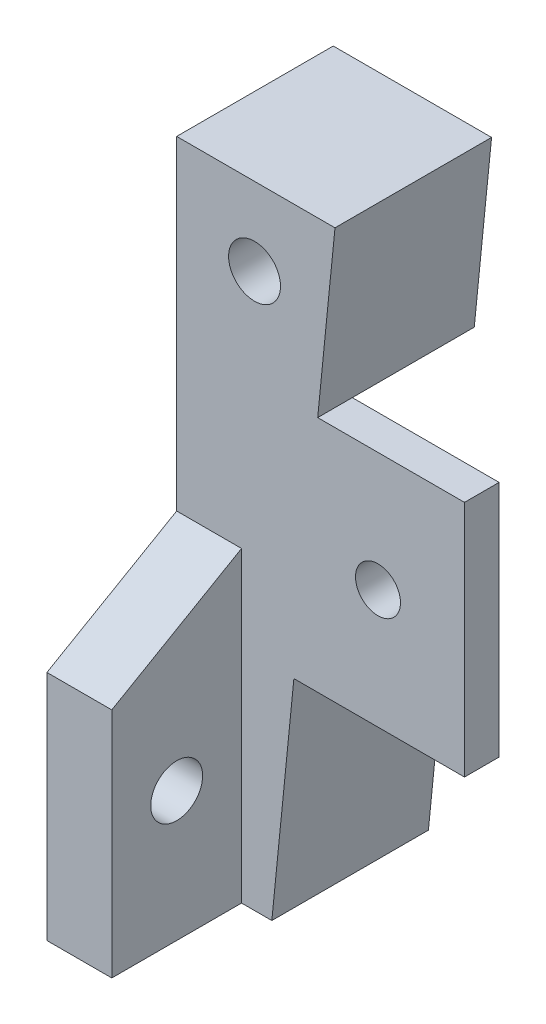
ISO-10303-21;
HEADER;
FILE_DESCRIPTION(('STEP AP214'),'2;1');
FILE_NAME('part.step','',(''),(''),'','','');
FILE_SCHEMA(('AUTOMOTIVE_DESIGN { 1 0 10303 214 1 1 1 1 }'));
ENDSEC;
DATA;
#1=APPLICATION_CONTEXT('core data for automotive mechanical design processes');
#2=APPLICATION_PROTOCOL_DEFINITION('international standard','automotive_design',2000,#1);
#3=PRODUCT_CONTEXT('',#1,'mechanical');
#4=PRODUCT('Part','Part','',(#3));
#5=PRODUCT_RELATED_PRODUCT_CATEGORY('part','',(#4));
#6=PRODUCT_DEFINITION_FORMATION('','',#4);
#7=PRODUCT_DEFINITION_CONTEXT('part definition',#1,'design');
#8=PRODUCT_DEFINITION('design','',#6,#7);
#9=PRODUCT_DEFINITION_SHAPE('','',#8);
#10=(LENGTH_UNIT() NAMED_UNIT(*) SI_UNIT(.MILLI.,.METRE.));
#11=(NAMED_UNIT(*) PLANE_ANGLE_UNIT() SI_UNIT($,.RADIAN.));
#12=(NAMED_UNIT(*) SI_UNIT($,.STERADIAN.) SOLID_ANGLE_UNIT());
#13=UNCERTAINTY_MEASURE_WITH_UNIT(LENGTH_MEASURE(1.E-05),#10,'distance_accuracy_value','');
#14=(GEOMETRIC_REPRESENTATION_CONTEXT(3) GLOBAL_UNCERTAINTY_ASSIGNED_CONTEXT((#13)) GLOBAL_UNIT_ASSIGNED_CONTEXT((#10,
#11,#12)) REPRESENTATION_CONTEXT('',''));
#15=CARTESIAN_POINT('',(0.,0.,0.));
#16=DIRECTION('',(0.,0.,1.));
#17=DIRECTION('',(1.,0.,0.));
#18=AXIS2_PLACEMENT_3D('',#15,#16,#17);
#19=CARTESIAN_POINT('',(0.,0.,14.1000000000013));
#20=DIRECTION('',(0.,0.,1.));
#21=DIRECTION('',(1.,0.,0.));
#22=AXIS2_PLACEMENT_3D('',#19,#20,#21);
#23=PLANE('',#22);
#24=CARTESIAN_POINT('',(137.270000000002,-335.749999999999,14.1000000000013));
#25=DIRECTION('',(0.,0.,1.));
#26=DIRECTION('',(1.,0.,0.));
#27=AXIS2_PLACEMENT_3D('',#24,#25,#26);
#28=CIRCLE('',#27,2.59999999999999);
#29=CARTESIAN_POINT('',(139.870000000002,-335.749999999999,14.1000000000013));
#30=VERTEX_POINT('',#29);
#31=EDGE_CURVE('E189',#30,#30,#28,.T.);
#32=ORIENTED_EDGE('',*,*,#31,.T.);
#33=EDGE_LOOP('',(#32));
#34=FACE_BOUND('',#33,.T.);
#35=DIRECTION('',(1.,0.,0.));
#36=VECTOR('',#35,1.);
#37=CARTESIAN_POINT('',(130.3,-321.999999999999,14.1000000000013));
#38=LINE('',#37,#36);
#39=CARTESIAN_POINT('',(114.000000000002,-321.999999999999,14.1000000000013));
#40=VERTEX_POINT('',#39);
#41=CARTESIAN_POINT('',(130.3,-321.999999999999,14.1000000000013));
#42=VERTEX_POINT('',#41);
#43=EDGE_CURVE('E208',#40,#42,#38,.T.);
#44=ORIENTED_EDGE('',*,*,#43,.T.);
#45=DIRECTION('',(1.,0.,0.));
#46=VECTOR('',#45,1.);
#47=CARTESIAN_POINT('',(-2.98656486156187E-11,-321.999999999986,14.1000000000013));
#48=LINE('',#47,#46);
#49=CARTESIAN_POINT('',(147.270000000011,-322.,14.1000000000013));
#50=VERTEX_POINT('',#49);
#51=EDGE_CURVE('E220',#42,#50,#48,.T.);
#52=ORIENTED_EDGE('',*,*,#51,.T.);
#53=DIRECTION('',(0.,1.,0.));
#54=VECTOR('',#53,1.);
#55=CARTESIAN_POINT('',(147.270000000011,-322.,14.1000000000013));
#56=LINE('',#55,#54);
#57=CARTESIAN_POINT('',(147.270000000011,-349.5,14.1000000000013));
#58=VERTEX_POINT('',#57);
#59=EDGE_CURVE('E198',#58,#50,#56,.T.);
#60=ORIENTED_EDGE('',*,*,#59,.F.);
#61=DIRECTION('',(-1.,0.,0.));
#62=VECTOR('',#61,1.);
#63=CARTESIAN_POINT('',(-2.63602545588444E-11,-349.499999999989,14.1000000000013));
#64=LINE('',#63,#62);
#65=CARTESIAN_POINT('',(127.55,-349.499999999999,14.1000000000013));
#66=VERTEX_POINT('',#65);
#67=EDGE_CURVE('E226',#58,#66,#64,.T.);
#68=ORIENTED_EDGE('',*,*,#67,.T.);
#69=DIRECTION('',(-1.,0.,0.));
#70=VECTOR('',#69,1.);
#71=CARTESIAN_POINT('',(127.55,-349.499999999999,14.1000000000013));
#72=LINE('',#71,#70);
#73=CARTESIAN_POINT('',(114.000000000002,-349.499999999999,14.1000000000013));
#74=VERTEX_POINT('',#73);
#75=EDGE_CURVE('E256',#66,#74,#72,.T.);
#76=ORIENTED_EDGE('',*,*,#75,.T.);
#77=DIRECTION('',(0.,1.,0.));
#78=VECTOR('',#77,1.);
#79=CARTESIAN_POINT('',(114.000000000002,0.,14.1000000000013));
#80=LINE('',#79,#78);
#81=EDGE_CURVE('E243',#74,#40,#80,.T.);
#82=ORIENTED_EDGE('',*,*,#81,.T.);
#83=EDGE_LOOP('',(#44,#52,#60,#68,#76,#82));
#84=FACE_BOUND('',#83,.T.);
#85=ADVANCED_FACE('F51',(#34,#84),#23,.F.);
#86=CARTESIAN_POINT('',(114.000000000002,-374.999999999999,42.976504289822));
#87=DIRECTION('',(1.36254643931287E-13,1.,0.));
#88=DIRECTION('',(-1.,1.36254643931287E-13,0.));
#89=AXIS2_PLACEMENT_3D('',#86,#87,#88);
#90=PLANE('',#89);
#91=DIRECTION('',(0.,0.,-1.));
#92=VECTOR('',#91,1.);
#93=CARTESIAN_POINT('',(125.,-375.,42.976504289822));
#94=LINE('',#93,#92);
#95=CARTESIAN_POINT('',(125.,-375.,18.1000000000013));
#96=VERTEX_POINT('',#95);
#97=CARTESIAN_POINT('',(125.,-375.,0.));
#98=VERTEX_POINT('',#97);
#99=EDGE_CURVE('E265',#96,#98,#94,.T.);
#100=ORIENTED_EDGE('',*,*,#99,.F.);
#101=DIRECTION('',(1.,-1.36254643931287E-13,0.));
#102=VECTOR('',#101,1.);
#103=CARTESIAN_POINT('',(-5.10954914742303E-11,-374.999999999983,18.1000000000013));
#104=LINE('',#103,#102);
#105=CARTESIAN_POINT('',(121.500000000002,-374.999999999999,18.1000000000013));
#106=VERTEX_POINT('',#105);
#107=EDGE_CURVE('E234',#106,#96,#104,.T.);
#108=ORIENTED_EDGE('',*,*,#107,.F.);
#109=DIRECTION('',(0.,0.,-1.));
#110=VECTOR('',#109,1.);
#111=CARTESIAN_POINT('',(121.500000000002,-374.999999999999,33.1000000000013));
#112=LINE('',#111,#110);
#113=CARTESIAN_POINT('',(121.500000000002,-374.999999999999,33.1000000000013));
#114=VERTEX_POINT('',#113);
#115=EDGE_CURVE('E167',#114,#106,#112,.T.);
#116=ORIENTED_EDGE('',*,*,#115,.F.);
#117=DIRECTION('',(1.,0.,0.));
#118=VECTOR('',#117,1.);
#119=CARTESIAN_POINT('',(114.000000000002,-374.999999999999,33.1000000000013));
#120=LINE('',#119,#118);
#121=CARTESIAN_POINT('',(114.000000000002,-374.999999999999,33.1000000000013));
#122=VERTEX_POINT('',#121);
#123=EDGE_CURVE('E162',#122,#114,#120,.T.);
#124=ORIENTED_EDGE('',*,*,#123,.F.);
#125=DIRECTION('',(0.,0.,-1.));
#126=VECTOR('',#125,1.);
#127=CARTESIAN_POINT('',(114.000000000002,-374.999999999999,42.976504289822));
#128=LINE('',#127,#126);
#129=CARTESIAN_POINT('',(114.000000000002,-374.999999999999,0.));
#130=VERTEX_POINT('',#129);
#131=EDGE_CURVE('E150',#122,#130,#128,.T.);
#132=ORIENTED_EDGE('',*,*,#131,.T.);
#133=DIRECTION('',(1.,-1.36254643931287E-13,0.));
#134=VECTOR('',#133,1.);
#135=CARTESIAN_POINT('',(114.000000000002,-374.999999999999,0.));
#136=LINE('',#135,#134);
#137=EDGE_CURVE('E158',#130,#98,#136,.T.);
#138=ORIENTED_EDGE('',*,*,#137,.T.);
#139=EDGE_LOOP('',(#100,#108,#116,#124,#132,#138));
#140=FACE_BOUND('',#139,.T.);
#141=ADVANCED_FACE('F164',(#140),#90,.F.);
#142=CARTESIAN_POINT('',(125.,-375.,42.976504289822));
#143=DIRECTION('',(-0.995037190209989,0.0995037190209987,0.));
#144=DIRECTION('',(-0.0995037190209987,-0.995037190209989,0.));
#145=AXIS2_PLACEMENT_3D('',#142,#143,#144);
#146=PLANE('',#145);
#147=DIRECTION('',(0.,0.,-1.));
#148=VECTOR('',#147,1.);
#149=CARTESIAN_POINT('',(127.55,-349.499999999999,42.976504289822));
#150=LINE('',#149,#148);
#151=CARTESIAN_POINT('',(127.55,-349.499999999999,0.));
#152=VERTEX_POINT('',#151);
#153=EDGE_CURVE('E261',#66,#152,#150,.T.);
#154=ORIENTED_EDGE('',*,*,#153,.F.);
#155=DIRECTION('',(0.,0.,-1.));
#156=VECTOR('',#155,1.);
#157=CARTESIAN_POINT('',(127.55,-349.499999999999,18.1000000000013));
#158=LINE('',#157,#156);
#159=CARTESIAN_POINT('',(127.55,-349.499999999999,18.1000000000013));
#160=VERTEX_POINT('',#159);
#161=EDGE_CURVE('E241',#160,#66,#158,.T.);
#162=ORIENTED_EDGE('',*,*,#161,.F.);
#163=DIRECTION('',(0.0995037190209987,0.995037190209989,0.));
#164=VECTOR('',#163,1.);
#165=CARTESIAN_POINT('',(160.891089108911,-16.0891089108911,18.1000000000013));
#166=LINE('',#165,#164);
#167=EDGE_CURVE('E236',#96,#160,#166,.T.);
#168=ORIENTED_EDGE('',*,*,#167,.F.);
#169=ORIENTED_EDGE('',*,*,#99,.T.);
#170=DIRECTION('',(0.0995037190209987,0.995037190209989,0.));
#171=VECTOR('',#170,1.);
#172=CARTESIAN_POINT('',(125.,-375.,0.));
#173=LINE('',#172,#171);
#174=EDGE_CURVE('E262',#98,#152,#173,.T.);
#175=ORIENTED_EDGE('',*,*,#174,.T.);
#176=EDGE_LOOP('',(#154,#162,#168,#169,#175));
#177=FACE_BOUND('',#176,.T.);
#178=ADVANCED_FACE('F294',(#177),#146,.F.);
#179=CARTESIAN_POINT('',(127.55,-349.499999999999,42.976504289822));
#180=DIRECTION('',(0.,-1.,0.));
#181=DIRECTION('',(0.,0.,-1.));
#182=AXIS2_PLACEMENT_3D('',#179,#180,#181);
#183=PLANE('',#182);
#184=ORIENTED_EDGE('',*,*,#75,.F.);
#185=ORIENTED_EDGE('',*,*,#153,.T.);
#186=DIRECTION('',(-1.,0.,0.));
#187=VECTOR('',#186,1.);
#188=CARTESIAN_POINT('',(127.55,-349.499999999999,0.));
#189=LINE('',#188,#187);
#190=CARTESIAN_POINT('',(114.000000000002,-349.499999999999,0.));
#191=VERTEX_POINT('',#190);
#192=EDGE_CURVE('E258',#152,#191,#189,.T.);
#193=ORIENTED_EDGE('',*,*,#192,.T.);
#194=DIRECTION('',(0.,0.,-1.));
#195=VECTOR('',#194,1.);
#196=CARTESIAN_POINT('',(114.000000000002,-349.499999999999,42.976504289822));
#197=LINE('',#196,#195);
#198=EDGE_CURVE('E257',#74,#191,#197,.T.);
#199=ORIENTED_EDGE('',*,*,#198,.F.);
#200=EDGE_LOOP('',(#184,#185,#193,#199));
#201=FACE_BOUND('',#200,.T.);
#202=ADVANCED_FACE('F325',(#201),#183,.F.);
#203=CARTESIAN_POINT('',(114.000000000002,-349.499999999999,42.976504289822));
#204=DIRECTION('',(1.,0.,0.));
#205=DIRECTION('',(0.,0.,-1.));
#206=AXIS2_PLACEMENT_3D('',#203,#204,#205);
#207=PLANE('',#206);
#208=CARTESIAN_POINT('',(114.000000000002,-359.999999999998,25.6000000000013));
#209=DIRECTION('',(1.,0.,0.));
#210=DIRECTION('',(0.,0.,-1.));
#211=AXIS2_PLACEMENT_3D('',#208,#209,#210);
#212=CIRCLE('',#211,3.);
#213=CARTESIAN_POINT('',(114.000000000002,-359.999999999998,22.6000000000013));
#214=VERTEX_POINT('',#213);
#215=EDGE_CURVE('E175',#214,#214,#212,.T.);
#216=ORIENTED_EDGE('',*,*,#215,.T.);
#217=EDGE_LOOP('',(#216));
#218=FACE_BOUND('',#217,.T.);
#219=ORIENTED_EDGE('',*,*,#131,.F.);
#220=DIRECTION('',(0.,-1.,0.));
#221=VECTOR('',#220,1.);
#222=CARTESIAN_POINT('',(114.000000000002,-374.999999999999,33.1000000000013));
#223=LINE('',#222,#221);
#224=CARTESIAN_POINT('',(114.000000000002,-348.160254037843,33.1000000000013));
#225=VERTEX_POINT('',#224);
#226=EDGE_CURVE('E74',#225,#122,#223,.T.);
#227=ORIENTED_EDGE('',*,*,#226,.F.);
#228=DIRECTION('',(0.,0.499999999999996,-0.866025403784441));
#229=VECTOR('',#228,1.);
#230=CARTESIAN_POINT('',(114.000000000002,-352.771842336167,41.0875052362892));
#231=LINE('',#230,#229);
#232=CARTESIAN_POINT('',(114.000000000002,-339.499999999998,18.1000000000013));
#233=VERTEX_POINT('',#232);
#234=EDGE_CURVE('E60',#225,#233,#231,.T.);
#235=ORIENTED_EDGE('',*,*,#234,.T.);
#236=DIRECTION('',(0.,1.,0.));
#237=VECTOR('',#236,1.);
#238=CARTESIAN_POINT('',(114.000000000002,0.,18.1000000000013));
#239=LINE('',#238,#237);
#240=CARTESIAN_POINT('',(114.000000000002,-301.999999999999,18.1000000000013));
#241=VERTEX_POINT('',#240);
#242=EDGE_CURVE('E232',#233,#241,#239,.T.);
#243=ORIENTED_EDGE('',*,*,#242,.T.);
#244=DIRECTION('',(0.,0.,-1.));
#245=VECTOR('',#244,1.);
#246=CARTESIAN_POINT('',(114.000000000002,-301.999999999999,18.1000000000013));
#247=LINE('',#246,#245);
#248=CARTESIAN_POINT('',(114.000000000002,-301.999999999999,0.));
#249=VERTEX_POINT('',#248);
#250=EDGE_CURVE('E249',#241,#249,#247,.T.);
#251=ORIENTED_EDGE('',*,*,#250,.T.);
#252=DIRECTION('',(0.,-1.,0.));
#253=VECTOR('',#252,1.);
#254=CARTESIAN_POINT('',(114.000000000002,-321.999999999999,0.));
#255=LINE('',#254,#253);
#256=CARTESIAN_POINT('',(114.000000000002,-321.999999999999,0.));
#257=VERTEX_POINT('',#256);
#258=EDGE_CURVE('E214',#249,#257,#255,.T.);
#259=ORIENTED_EDGE('',*,*,#258,.T.);
#260=DIRECTION('',(0.,0.,-1.));
#261=VECTOR('',#260,1.);
#262=CARTESIAN_POINT('',(114.000000000002,-321.999999999999,42.976504289822));
#263=LINE('',#262,#261);
#264=EDGE_CURVE('E213',#40,#257,#263,.T.);
#265=ORIENTED_EDGE('',*,*,#264,.F.);
#266=ORIENTED_EDGE('',*,*,#81,.F.);
#267=ORIENTED_EDGE('',*,*,#198,.T.);
#268=DIRECTION('',(0.,-1.,0.));
#269=VECTOR('',#268,1.);
#270=CARTESIAN_POINT('',(114.000000000002,-349.499999999999,0.));
#271=LINE('',#270,#269);
#272=EDGE_CURVE('E154',#191,#130,#271,.T.);
#273=ORIENTED_EDGE('',*,*,#272,.T.);
#274=EDGE_LOOP('',(#219,#227,#235,#243,#251,#259,#265,#266,#267,#273));
#275=FACE_BOUND('',#274,.T.);
#276=ADVANCED_FACE('F152',(#218,#275),#207,.F.);
#277=CARTESIAN_POINT('',(0.,0.,0.));
#278=DIRECTION('',(0.,0.,-1.));
#279=DIRECTION('',(-1.,0.,0.));
#280=AXIS2_PLACEMENT_3D('',#277,#278,#279);
#281=PLANE('',#280);
#282=ORIENTED_EDGE('',*,*,#137,.F.);
#283=ORIENTED_EDGE('',*,*,#272,.F.);
#284=ORIENTED_EDGE('',*,*,#192,.F.);
#285=ORIENTED_EDGE('',*,*,#174,.F.);
#286=EDGE_LOOP('',(#282,#283,#284,#285));
#287=FACE_BOUND('',#286,.T.);
#288=ADVANCED_FACE('F328',(#287),#281,.T.);
#289=CARTESIAN_POINT('',(-2.98656486156187E-11,-321.999999999986,18.1000000000013));
#290=DIRECTION('',(0.,1.,0.));
#291=DIRECTION('',(-1.,0.,0.));
#292=AXIS2_PLACEMENT_3D('',#289,#290,#291);
#293=PLANE('',#292);
#294=ORIENTED_EDGE('',*,*,#51,.F.);
#295=DIRECTION('',(0.,0.,-1.));
#296=VECTOR('',#295,1.);
#297=CARTESIAN_POINT('',(130.3,-321.999999999999,18.1000000000013));
#298=LINE('',#297,#296);
#299=CARTESIAN_POINT('',(130.3,-321.999999999999,18.1000000000013));
#300=VERTEX_POINT('',#299);
#301=EDGE_CURVE('E159',#300,#42,#298,.T.);
#302=ORIENTED_EDGE('',*,*,#301,.F.);
#303=DIRECTION('',(1.,0.,0.));
#304=VECTOR('',#303,1.);
#305=CARTESIAN_POINT('',(-2.98656486156187E-11,-321.999999999986,18.1000000000013));
#306=LINE('',#305,#304);
#307=CARTESIAN_POINT('',(147.270000000011,-322.,18.1000000000013));
#308=VERTEX_POINT('',#307);
#309=EDGE_CURVE('E223',#300,#308,#306,.T.);
#310=ORIENTED_EDGE('',*,*,#309,.T.);
#311=DIRECTION('',(0.,0.,1.));
#312=VECTOR('',#311,1.);
#313=CARTESIAN_POINT('',(147.270000000011,-322.,18.1000000000013));
#314=LINE('',#313,#312);
#315=EDGE_CURVE('E201',#50,#308,#314,.T.);
#316=ORIENTED_EDGE('',*,*,#315,.F.);
#317=EDGE_LOOP('',(#294,#302,#310,#316));
#318=FACE_BOUND('',#317,.T.);
#319=ADVANCED_FACE('F306',(#318),#293,.T.);
#320=CARTESIAN_POINT('',(160.891089108911,-16.0891089108911,18.1000000000013));
#321=DIRECTION('',(0.995037190209989,-0.0995037190209989,0.));
#322=DIRECTION('',(0.0995037190209989,0.995037190209989,0.));
#323=AXIS2_PLACEMENT_3D('',#320,#321,#322);
#324=PLANE('',#323);
#325=ORIENTED_EDGE('',*,*,#301,.T.);
#326=DIRECTION('',(0.,0.,-1.));
#327=VECTOR('',#326,1.);
#328=CARTESIAN_POINT('',(130.3,-321.999999999999,42.976504289822));
#329=LINE('',#328,#327);
#330=CARTESIAN_POINT('',(130.3,-321.999999999999,0.));
#331=VERTEX_POINT('',#330);
#332=EDGE_CURVE('E209',#42,#331,#329,.T.);
#333=ORIENTED_EDGE('',*,*,#332,.T.);
#334=DIRECTION('',(0.0995037190209989,0.995037190209989,0.));
#335=VECTOR('',#334,1.);
#336=CARTESIAN_POINT('',(132.3,-301.999999999999,0.));
#337=LINE('',#336,#335);
#338=CARTESIAN_POINT('',(132.3,-301.999999999999,0.));
#339=VERTEX_POINT('',#338);
#340=EDGE_CURVE('E205',#331,#339,#337,.T.);
#341=ORIENTED_EDGE('',*,*,#340,.T.);
#342=DIRECTION('',(0.,0.,-1.));
#343=VECTOR('',#342,1.);
#344=CARTESIAN_POINT('',(132.3,-301.999999999999,18.1000000000013));
#345=LINE('',#344,#343);
#346=CARTESIAN_POINT('',(132.3,-301.999999999999,18.1000000000013));
#347=VERTEX_POINT('',#346);
#348=EDGE_CURVE('E251',#347,#339,#345,.T.);
#349=ORIENTED_EDGE('',*,*,#348,.F.);
#350=DIRECTION('',(-0.0995037190209988,-0.995037190209989,0.));
#351=VECTOR('',#350,1.);
#352=CARTESIAN_POINT('',(160.891089108911,-16.0891089108911,18.1000000000013));
#353=LINE('',#352,#351);
#354=EDGE_CURVE('E225',#347,#300,#353,.T.);
#355=ORIENTED_EDGE('',*,*,#354,.T.);
#356=EDGE_LOOP('',(#325,#333,#341,#349,#355));
#357=FACE_BOUND('',#356,.T.);
#358=ADVANCED_FACE('F309',(#357),#324,.T.);
#359=CARTESIAN_POINT('',(0.,-301.999999999999,18.1000000000013));
#360=DIRECTION('',(0.,1.,0.));
#361=DIRECTION('',(0.,0.,1.));
#362=AXIS2_PLACEMENT_3D('',#359,#360,#361);
#363=PLANE('',#362);
#364=ORIENTED_EDGE('',*,*,#348,.T.);
#365=DIRECTION('',(-1.,0.,0.));
#366=VECTOR('',#365,1.);
#367=CARTESIAN_POINT('',(114.000000000002,-301.999999999999,0.));
#368=LINE('',#367,#366);
#369=EDGE_CURVE('E204',#339,#249,#368,.T.);
#370=ORIENTED_EDGE('',*,*,#369,.T.);
#371=ORIENTED_EDGE('',*,*,#250,.F.);
#372=DIRECTION('',(1.,0.,0.));
#373=VECTOR('',#372,1.);
#374=CARTESIAN_POINT('',(0.,-301.999999999999,18.1000000000013));
#375=LINE('',#374,#373);
#376=EDGE_CURVE('E229',#241,#347,#375,.T.);
#377=ORIENTED_EDGE('',*,*,#376,.T.);
#378=EDGE_LOOP('',(#364,#370,#371,#377));
#379=FACE_BOUND('',#378,.T.);
#380=ADVANCED_FACE('F313',(#379),#363,.T.);
#381=CARTESIAN_POINT('',(-2.63602545588444E-11,-349.499999999989,18.1000000000013));
#382=DIRECTION('',(0.,-1.,0.));
#383=DIRECTION('',(1.,0.,0.));
#384=AXIS2_PLACEMENT_3D('',#381,#382,#383);
#385=PLANE('',#384);
#386=ORIENTED_EDGE('',*,*,#67,.F.);
#387=DIRECTION('',(0.,0.,-1.));
#388=VECTOR('',#387,1.);
#389=CARTESIAN_POINT('',(147.270000000011,-349.5,18.1000000000013));
#390=LINE('',#389,#388);
#391=CARTESIAN_POINT('',(147.270000000011,-349.5,18.1000000000013));
#392=VERTEX_POINT('',#391);
#393=EDGE_CURVE('E195',#392,#58,#390,.T.);
#394=ORIENTED_EDGE('',*,*,#393,.F.);
#395=DIRECTION('',(-1.,0.,0.));
#396=VECTOR('',#395,1.);
#397=CARTESIAN_POINT('',(-2.63602545588444E-11,-349.499999999989,18.1000000000013));
#398=LINE('',#397,#396);
#399=EDGE_CURVE('E238',#392,#160,#398,.T.);
#400=ORIENTED_EDGE('',*,*,#399,.T.);
#401=ORIENTED_EDGE('',*,*,#161,.T.);
#402=EDGE_LOOP('',(#386,#394,#400,#401));
#403=FACE_BOUND('',#402,.T.);
#404=ADVANCED_FACE('F299',(#403),#385,.T.);
#405=CARTESIAN_POINT('',(0.,0.,18.1000000000013));
#406=DIRECTION('',(0.,0.,1.));
#407=DIRECTION('',(1.,0.,0.));
#408=AXIS2_PLACEMENT_3D('',#405,#406,#407);
#409=PLANE('',#408);
#410=ORIENTED_EDGE('',*,*,#242,.F.);
#411=DIRECTION('',(1.,0.,0.));
#412=VECTOR('',#411,1.);
#413=CARTESIAN_POINT('',(0.,-339.499999999998,18.1000000000013));
#414=LINE('',#413,#412);
#415=CARTESIAN_POINT('',(121.500000000002,-339.499999999998,18.1000000000013));
#416=VERTEX_POINT('',#415);
#417=EDGE_CURVE('E269',#233,#416,#414,.T.);
#418=ORIENTED_EDGE('',*,*,#417,.T.);
#419=DIRECTION('',(0.,1.,0.));
#420=VECTOR('',#419,1.);
#421=CARTESIAN_POINT('',(121.500000000002,-374.999999999999,18.1000000000013));
#422=LINE('',#421,#420);
#423=EDGE_CURVE('E173',#106,#416,#422,.T.);
#424=ORIENTED_EDGE('',*,*,#423,.F.);
#425=ORIENTED_EDGE('',*,*,#107,.T.);
#426=ORIENTED_EDGE('',*,*,#167,.T.);
#427=ORIENTED_EDGE('',*,*,#399,.F.);
#428=DIRECTION('',(0.,-1.,0.));
#429=VECTOR('',#428,1.);
#430=CARTESIAN_POINT('',(147.270000000011,-322.,18.1000000000013));
#431=LINE('',#430,#429);
#432=EDGE_CURVE('E192',#308,#392,#431,.T.);
#433=ORIENTED_EDGE('',*,*,#432,.F.);
#434=ORIENTED_EDGE('',*,*,#309,.F.);
#435=ORIENTED_EDGE('',*,*,#354,.F.);
#436=ORIENTED_EDGE('',*,*,#376,.F.);
#437=EDGE_LOOP('',(#410,#418,#424,#425,#426,#427,#433,#434,#435,#436));
#438=FACE_BOUND('',#437,.T.);
#439=CARTESIAN_POINT('',(137.270000000002,-335.749999999999,18.1000000000013));
#440=DIRECTION('',(0.,0.,1.));
#441=DIRECTION('',(1.,0.,0.));
#442=AXIS2_PLACEMENT_3D('',#439,#440,#441);
#443=CIRCLE('',#442,2.59999999999999);
#444=CARTESIAN_POINT('',(139.870000000002,-335.749999999999,18.1000000000013));
#445=VERTEX_POINT('',#444);
#446=EDGE_CURVE('E183',#445,#445,#443,.T.);
#447=ORIENTED_EDGE('',*,*,#446,.F.);
#448=EDGE_LOOP('',(#447));
#449=FACE_BOUND('',#448,.T.);
#450=CARTESIAN_POINT('',(123.000000000002,-310.999999999999,18.1000000000013));
#451=DIRECTION('',(0.,0.,1.));
#452=DIRECTION('',(1.,0.,0.));
#453=AXIS2_PLACEMENT_3D('',#450,#451,#452);
#454=CIRCLE('',#453,2.99999999999996);
#455=CARTESIAN_POINT('',(126.000000000002,-310.999999999999,18.1000000000013));
#456=VERTEX_POINT('',#455);
#457=EDGE_CURVE('E182',#456,#456,#454,.T.);
#458=ORIENTED_EDGE('',*,*,#457,.F.);
#459=EDGE_LOOP('',(#458));
#460=FACE_BOUND('',#459,.T.);
#461=ADVANCED_FACE('F283',(#438,#449,#460),#409,.T.);
#462=CARTESIAN_POINT('',(130.3,-321.999999999999,42.976504289822));
#463=DIRECTION('',(0.,1.,0.));
#464=DIRECTION('',(0.,0.,1.));
#465=AXIS2_PLACEMENT_3D('',#462,#463,#464);
#466=PLANE('',#465);
#467=ORIENTED_EDGE('',*,*,#43,.F.);
#468=ORIENTED_EDGE('',*,*,#264,.T.);
#469=DIRECTION('',(1.,0.,0.));
#470=VECTOR('',#469,1.);
#471=CARTESIAN_POINT('',(130.3,-321.999999999999,0.));
#472=LINE('',#471,#470);
#473=EDGE_CURVE('E210',#257,#331,#472,.T.);
#474=ORIENTED_EDGE('',*,*,#473,.T.);
#475=ORIENTED_EDGE('',*,*,#332,.F.);
#476=EDGE_LOOP('',(#467,#468,#474,#475));
#477=FACE_BOUND('',#476,.T.);
#478=ADVANCED_FACE('F321',(#477),#466,.F.);
#479=CARTESIAN_POINT('',(0.,0.,0.));
#480=DIRECTION('',(0.,0.,1.));
#481=DIRECTION('',(1.,0.,0.));
#482=AXIS2_PLACEMENT_3D('',#479,#480,#481);
#483=PLANE('',#482);
#484=CARTESIAN_POINT('',(123.000000000002,-310.999999999999,0.));
#485=DIRECTION('',(0.,0.,1.));
#486=DIRECTION('',(1.,0.,0.));
#487=AXIS2_PLACEMENT_3D('',#484,#485,#486);
#488=CIRCLE('',#487,2.99999999999996);
#489=CARTESIAN_POINT('',(126.000000000002,-310.999999999999,0.));
#490=VERTEX_POINT('',#489);
#491=EDGE_CURVE('E186',#490,#490,#488,.T.);
#492=ORIENTED_EDGE('',*,*,#491,.T.);
#493=EDGE_LOOP('',(#492));
#494=FACE_BOUND('',#493,.T.);
#495=ORIENTED_EDGE('',*,*,#369,.F.);
#496=ORIENTED_EDGE('',*,*,#340,.F.);
#497=ORIENTED_EDGE('',*,*,#473,.F.);
#498=ORIENTED_EDGE('',*,*,#258,.F.);
#499=EDGE_LOOP('',(#495,#496,#497,#498));
#500=FACE_BOUND('',#499,.T.);
#501=ADVANCED_FACE('F318',(#494,#500),#483,.F.);
#502=CARTESIAN_POINT('',(147.270000000009,1.0384521525515E-12,0.));
#503=DIRECTION('',(1.,0.,0.));
#504=DIRECTION('',(0.,1.,0.));
#505=AXIS2_PLACEMENT_3D('',#502,#503,#504);
#506=PLANE('',#505);
#507=ORIENTED_EDGE('',*,*,#432,.T.);
#508=ORIENTED_EDGE('',*,*,#393,.T.);
#509=ORIENTED_EDGE('',*,*,#59,.T.);
#510=ORIENTED_EDGE('',*,*,#315,.T.);
#511=EDGE_LOOP('',(#507,#508,#509,#510));
#512=FACE_BOUND('',#511,.T.);
#513=ADVANCED_FACE('F302',(#512),#506,.T.);
#514=CARTESIAN_POINT('',(123.000000000002,-310.999999999999,-16.8999999999987));
#515=DIRECTION('',(0.,0.,1.));
#516=DIRECTION('',(1.,0.,0.));
#517=AXIS2_PLACEMENT_3D('',#514,#515,#516);
#518=CYLINDRICAL_SURFACE('',#517,2.99999999999996);
#519=ORIENTED_EDGE('',*,*,#457,.T.);
#520=EDGE_LOOP('',(#519));
#521=FACE_BOUND('',#520,.T.);
#522=ORIENTED_EDGE('',*,*,#491,.F.);
#523=EDGE_LOOP('',(#522));
#524=FACE_BOUND('',#523,.T.);
#525=ADVANCED_FACE('F387',(#521,#524),#518,.F.);
#526=CARTESIAN_POINT('',(137.270000000002,-335.749999999999,-16.8999999999987));
#527=DIRECTION('',(0.,0.,1.));
#528=DIRECTION('',(1.,0.,0.));
#529=AXIS2_PLACEMENT_3D('',#526,#527,#528);
#530=CYLINDRICAL_SURFACE('',#529,2.59999999999999);
#531=ORIENTED_EDGE('',*,*,#446,.T.);
#532=EDGE_LOOP('',(#531));
#533=FACE_BOUND('',#532,.T.);
#534=ORIENTED_EDGE('',*,*,#31,.F.);
#535=EDGE_LOOP('',(#534));
#536=FACE_BOUND('',#535,.T.);
#537=ADVANCED_FACE('F400',(#533,#536),#530,.F.);
#538=CARTESIAN_POINT('',(121.500000000002,-374.999999999999,33.1000000000013));
#539=DIRECTION('',(-1.,0.,0.));
#540=DIRECTION('',(0.,0.,1.));
#541=AXIS2_PLACEMENT_3D('',#538,#539,#540);
#542=PLANE('',#541);
#543=CARTESIAN_POINT('',(121.500000000002,-359.999999999998,25.6000000000013));
#544=DIRECTION('',(1.,0.,0.));
#545=DIRECTION('',(0.,0.,-1.));
#546=AXIS2_PLACEMENT_3D('',#543,#544,#545);
#547=CIRCLE('',#546,3.);
#548=CARTESIAN_POINT('',(121.500000000002,-359.999999999998,22.6000000000013));
#549=VERTEX_POINT('',#548);
#550=EDGE_CURVE('E519',#549,#549,#547,.T.);
#551=ORIENTED_EDGE('',*,*,#550,.F.);
#552=EDGE_LOOP('',(#551));
#553=FACE_BOUND('',#552,.T.);
#554=ORIENTED_EDGE('',*,*,#423,.T.);
#555=DIRECTION('',(0.,-0.499999999999996,0.866025403784441));
#556=VECTOR('',#555,1.);
#557=CARTESIAN_POINT('',(121.500000000002,-354.870190528382,44.7219509171751));
#558=LINE('',#557,#556);
#559=CARTESIAN_POINT('',(121.500000000002,-348.160254037843,33.1000000000013));
#560=VERTEX_POINT('',#559);
#561=EDGE_CURVE('E11',#416,#560,#558,.T.);
#562=ORIENTED_EDGE('',*,*,#561,.T.);
#563=DIRECTION('',(0.,1.,0.));
#564=VECTOR('',#563,1.);
#565=CARTESIAN_POINT('',(121.500000000002,-374.999999999999,33.1000000000013));
#566=LINE('',#565,#564);
#567=EDGE_CURVE('E67',#114,#560,#566,.T.);
#568=ORIENTED_EDGE('',*,*,#567,.F.);
#569=ORIENTED_EDGE('',*,*,#115,.T.);
#570=EDGE_LOOP('',(#554,#562,#568,#569));
#571=FACE_BOUND('',#570,.T.);
#572=ADVANCED_FACE('F288',(#553,#571),#542,.F.);
#573=CARTESIAN_POINT('',(0.,0.,33.1000000000013));
#574=DIRECTION('',(0.,0.,-1.));
#575=DIRECTION('',(-1.,0.,0.));
#576=AXIS2_PLACEMENT_3D('',#573,#574,#575);
#577=PLANE('',#576);
#578=ORIENTED_EDGE('',*,*,#226,.T.);
#579=ORIENTED_EDGE('',*,*,#123,.T.);
#580=ORIENTED_EDGE('',*,*,#567,.T.);
#581=DIRECTION('',(-1.,0.,0.));
#582=VECTOR('',#581,1.);
#583=CARTESIAN_POINT('',(0.,-348.160254037843,33.1000000000013));
#584=LINE('',#583,#582);
#585=EDGE_CURVE('E171',#560,#225,#584,.T.);
#586=ORIENTED_EDGE('',*,*,#585,.T.);
#587=EDGE_LOOP('',(#578,#579,#580,#586));
#588=FACE_BOUND('',#587,.T.);
#589=ADVANCED_FACE('F169',(#588),#577,.F.);
#590=CARTESIAN_POINT('',(114.000000000002,-349.499999999999,35.4205080756904));
#591=DIRECTION('',(0.,-0.866025403784441,-0.499999999999996));
#592=DIRECTION('',(-1.,0.,0.));
#593=AXIS2_PLACEMENT_3D('',#590,#591,#592);
#594=PLANE('',#593);
#595=ORIENTED_EDGE('',*,*,#561,.F.);
#596=ORIENTED_EDGE('',*,*,#417,.F.);
#597=ORIENTED_EDGE('',*,*,#234,.F.);
#598=ORIENTED_EDGE('',*,*,#585,.F.);
#599=EDGE_LOOP('',(#595,#596,#597,#598));
#600=FACE_BOUND('',#599,.T.);
#601=ADVANCED_FACE('F54',(#600),#594,.F.);
#602=CARTESIAN_POINT('',(121.500000000002,-359.999999999998,25.6000000000013));
#603=DIRECTION('',(1.,0.,0.));
#604=DIRECTION('',(0.,0.,-1.));
#605=AXIS2_PLACEMENT_3D('',#602,#603,#604);
#606=CYLINDRICAL_SURFACE('',#605,3.);
#607=ORIENTED_EDGE('',*,*,#215,.F.);
#608=EDGE_LOOP('',(#607));
#609=FACE_BOUND('',#608,.T.);
#610=ORIENTED_EDGE('',*,*,#550,.T.);
#611=EDGE_LOOP('',(#610));
#612=FACE_BOUND('',#611,.T.);
#613=ADVANCED_FACE('F446',(#609,#612),#606,.F.);
#614=CLOSED_SHELL('',(#85,#141,#178,#202,#276,#288,#319,#358,#380,#404,#461,#478,#501,#513,#525,
#537,#572,#589,#601,#613));
#615=MANIFOLD_SOLID_BREP('B2',#614);
#616=ADVANCED_BREP_SHAPE_REPRESENTATION('',(#18,#615),#14);
#617=SHAPE_DEFINITION_REPRESENTATION(#9,#616);
ENDSEC;
END-ISO-10303-21;
